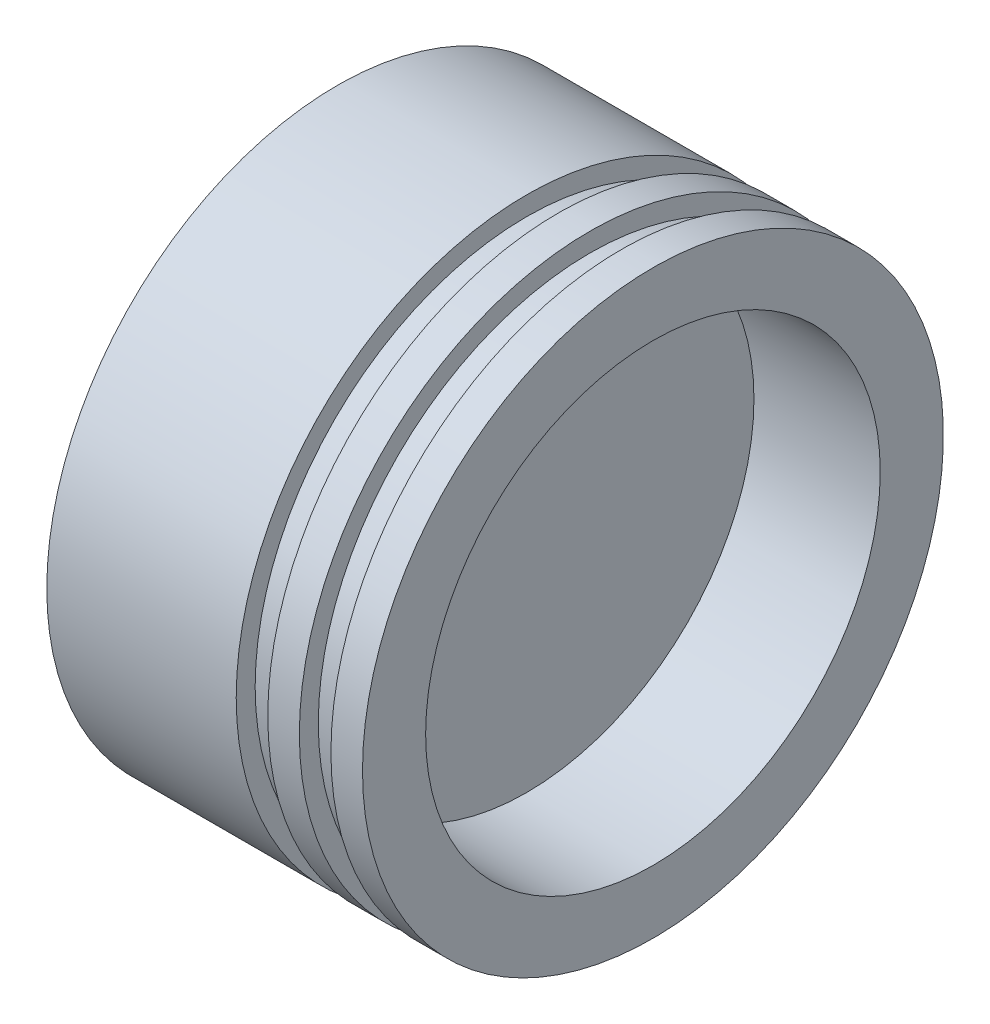
ISO-10303-21;
HEADER;
FILE_DESCRIPTION(('STEP AP214'),'2;1');
FILE_NAME('part.step','',(''),(''),'','','');
FILE_SCHEMA(('AUTOMOTIVE_DESIGN { 1 0 10303 214 1 1 1 1 }'));
ENDSEC;
DATA;
#1=APPLICATION_CONTEXT('core data for automotive mechanical design processes');
#2=APPLICATION_PROTOCOL_DEFINITION('international standard','automotive_design',2000,#1);
#3=PRODUCT_CONTEXT('',#1,'mechanical');
#4=PRODUCT('Part','Part','',(#3));
#5=PRODUCT_RELATED_PRODUCT_CATEGORY('part','',(#4));
#6=PRODUCT_DEFINITION_FORMATION('','',#4);
#7=PRODUCT_DEFINITION_CONTEXT('part definition',#1,'design');
#8=PRODUCT_DEFINITION('design','',#6,#7);
#9=PRODUCT_DEFINITION_SHAPE('','',#8);
#10=(LENGTH_UNIT() NAMED_UNIT(*) SI_UNIT(.MILLI.,.METRE.));
#11=(NAMED_UNIT(*) PLANE_ANGLE_UNIT() SI_UNIT($,.RADIAN.));
#12=(NAMED_UNIT(*) SI_UNIT($,.STERADIAN.) SOLID_ANGLE_UNIT());
#13=UNCERTAINTY_MEASURE_WITH_UNIT(LENGTH_MEASURE(1.E-05),#10,'distance_accuracy_value','');
#14=(GEOMETRIC_REPRESENTATION_CONTEXT(3) GLOBAL_UNCERTAINTY_ASSIGNED_CONTEXT((#13)) GLOBAL_UNIT_ASSIGNED_CONTEXT((#10,
#11,#12)) REPRESENTATION_CONTEXT('',''));
#15=CARTESIAN_POINT('',(0.,0.,0.));
#16=DIRECTION('',(0.,0.,1.));
#17=DIRECTION('',(1.,0.,0.));
#18=AXIS2_PLACEMENT_3D('',#15,#16,#17);
#19=CARTESIAN_POINT('',(0.,0.,0.));
#20=DIRECTION('',(1.,0.,0.));
#21=DIRECTION('',(0.,0.,-1.));
#22=AXIS2_PLACEMENT_3D('',#19,#20,#21);
#23=PLANE('',#22);
#24=CARTESIAN_POINT('',(0.,0.,0.));
#25=DIRECTION('',(-1.,0.,0.));
#26=DIRECTION('',(0.,0.,1.));
#27=AXIS2_PLACEMENT_3D('',#24,#25,#26);
#28=CIRCLE('',#27,46.);
#29=CARTESIAN_POINT('',(0.,0.,46.));
#30=VERTEX_POINT('',#29);
#31=EDGE_CURVE('E10',#30,#30,#28,.T.);
#32=ORIENTED_EDGE('',*,*,#31,.T.);
#33=EDGE_LOOP('',(#32));
#34=FACE_BOUND('',#33,.T.);
#35=ADVANCED_FACE('F35',(#34),#23,.F.);
#36=CARTESIAN_POINT('',(0.,0.,0.));
#37=DIRECTION('',(-1.,0.,0.));
#38=DIRECTION('',(0.,0.,1.));
#39=AXIS2_PLACEMENT_3D('',#36,#37,#38);
#40=CYLINDRICAL_SURFACE('',#39,46.);
#41=ORIENTED_EDGE('',*,*,#31,.F.);
#42=EDGE_LOOP('',(#41));
#43=FACE_BOUND('',#42,.T.);
#44=CARTESIAN_POINT('',(30.,0.,0.));
#45=DIRECTION('',(-1.,0.,0.));
#46=DIRECTION('',(0.,0.,1.));
#47=AXIS2_PLACEMENT_3D('',#44,#45,#46);
#48=CIRCLE('',#47,46.);
#49=CARTESIAN_POINT('',(30.,0.,46.));
#50=VERTEX_POINT('',#49);
#51=EDGE_CURVE('E41',#50,#50,#48,.T.);
#52=ORIENTED_EDGE('',*,*,#51,.T.);
#53=EDGE_LOOP('',(#52));
#54=FACE_BOUND('',#53,.T.);
#55=ADVANCED_FACE('F91',(#43,#54),#40,.T.);
#56=CARTESIAN_POINT('',(30.,46.,0.));
#57=DIRECTION('',(-1.,0.,0.));
#58=DIRECTION('',(0.,0.,1.));
#59=AXIS2_PLACEMENT_3D('',#56,#57,#58);
#60=PLANE('',#59);
#61=ORIENTED_EDGE('',*,*,#51,.F.);
#62=EDGE_LOOP('',(#61));
#63=FACE_BOUND('',#62,.T.);
#64=CARTESIAN_POINT('',(30.,0.,0.));
#65=DIRECTION('',(-1.,0.,0.));
#66=DIRECTION('',(0.,0.,1.));
#67=AXIS2_PLACEMENT_3D('',#64,#65,#66);
#68=CIRCLE('',#67,43.);
#69=CARTESIAN_POINT('',(30.,0.,43.));
#70=VERTEX_POINT('',#69);
#71=EDGE_CURVE('E45',#70,#70,#68,.T.);
#72=ORIENTED_EDGE('',*,*,#71,.T.);
#73=EDGE_LOOP('',(#72));
#74=FACE_BOUND('',#73,.T.);
#75=ADVANCED_FACE('F95',(#63,#74),#60,.F.);
#76=CARTESIAN_POINT('',(0.,0.,0.));
#77=DIRECTION('',(-1.,0.,0.));
#78=DIRECTION('',(0.,0.,1.));
#79=AXIS2_PLACEMENT_3D('',#76,#77,#78);
#80=CYLINDRICAL_SURFACE('',#79,43.);
#81=ORIENTED_EDGE('',*,*,#71,.F.);
#82=EDGE_LOOP('',(#81));
#83=FACE_BOUND('',#82,.T.);
#84=CARTESIAN_POINT('',(35.,0.,0.));
#85=DIRECTION('',(-1.,0.,0.));
#86=DIRECTION('',(0.,0.,1.));
#87=AXIS2_PLACEMENT_3D('',#84,#85,#86);
#88=CIRCLE('',#87,43.);
#89=CARTESIAN_POINT('',(35.,0.,43.));
#90=VERTEX_POINT('',#89);
#91=EDGE_CURVE('E49',#90,#90,#88,.T.);
#92=ORIENTED_EDGE('',*,*,#91,.T.);
#93=EDGE_LOOP('',(#92));
#94=FACE_BOUND('',#93,.T.);
#95=ADVANCED_FACE('F100',(#83,#94),#80,.T.);
#96=CARTESIAN_POINT('',(35.,43.,0.));
#97=DIRECTION('',(1.,0.,0.));
#98=DIRECTION('',(0.,0.,-1.));
#99=AXIS2_PLACEMENT_3D('',#96,#97,#98);
#100=PLANE('',#99);
#101=ORIENTED_EDGE('',*,*,#91,.F.);
#102=EDGE_LOOP('',(#101));
#103=FACE_BOUND('',#102,.T.);
#104=CARTESIAN_POINT('',(35.,0.,0.));
#105=DIRECTION('',(-1.,0.,0.));
#106=DIRECTION('',(0.,0.,1.));
#107=AXIS2_PLACEMENT_3D('',#104,#105,#106);
#108=CIRCLE('',#107,46.);
#109=CARTESIAN_POINT('',(35.,0.,46.));
#110=VERTEX_POINT('',#109);
#111=EDGE_CURVE('E54',#110,#110,#108,.T.);
#112=ORIENTED_EDGE('',*,*,#111,.T.);
#113=EDGE_LOOP('',(#112));
#114=FACE_BOUND('',#113,.T.);
#115=ADVANCED_FACE('F106',(#103,#114),#100,.F.);
#116=CARTESIAN_POINT('',(0.,0.,0.));
#117=DIRECTION('',(-1.,0.,0.));
#118=DIRECTION('',(0.,0.,1.));
#119=AXIS2_PLACEMENT_3D('',#116,#117,#118);
#120=CYLINDRICAL_SURFACE('',#119,46.);
#121=ORIENTED_EDGE('',*,*,#111,.F.);
#122=EDGE_LOOP('',(#121));
#123=FACE_BOUND('',#122,.T.);
#124=CARTESIAN_POINT('',(40.,0.,0.));
#125=DIRECTION('',(-1.,0.,0.));
#126=DIRECTION('',(0.,0.,1.));
#127=AXIS2_PLACEMENT_3D('',#124,#125,#126);
#128=CIRCLE('',#127,46.);
#129=CARTESIAN_POINT('',(40.,0.,46.));
#130=VERTEX_POINT('',#129);
#131=EDGE_CURVE('E57',#130,#130,#128,.T.);
#132=ORIENTED_EDGE('',*,*,#131,.T.);
#133=EDGE_LOOP('',(#132));
#134=FACE_BOUND('',#133,.T.);
#135=ADVANCED_FACE('F110',(#123,#134),#120,.T.);
#136=CARTESIAN_POINT('',(40.,46.,0.));
#137=DIRECTION('',(-1.,0.,0.));
#138=DIRECTION('',(0.,0.,1.));
#139=AXIS2_PLACEMENT_3D('',#136,#137,#138);
#140=PLANE('',#139);
#141=ORIENTED_EDGE('',*,*,#131,.F.);
#142=EDGE_LOOP('',(#141));
#143=FACE_BOUND('',#142,.T.);
#144=CARTESIAN_POINT('',(40.,0.,0.));
#145=DIRECTION('',(-1.,0.,0.));
#146=DIRECTION('',(0.,0.,1.));
#147=AXIS2_PLACEMENT_3D('',#144,#145,#146);
#148=CIRCLE('',#147,43.);
#149=CARTESIAN_POINT('',(40.,0.,43.));
#150=VERTEX_POINT('',#149);
#151=EDGE_CURVE('E60',#150,#150,#148,.T.);
#152=ORIENTED_EDGE('',*,*,#151,.T.);
#153=EDGE_LOOP('',(#152));
#154=FACE_BOUND('',#153,.T.);
#155=ADVANCED_FACE('F114',(#143,#154),#140,.F.);
#156=CARTESIAN_POINT('',(0.,0.,0.));
#157=DIRECTION('',(-1.,0.,0.));
#158=DIRECTION('',(0.,0.,1.));
#159=AXIS2_PLACEMENT_3D('',#156,#157,#158);
#160=CYLINDRICAL_SURFACE('',#159,43.);
#161=ORIENTED_EDGE('',*,*,#151,.F.);
#162=EDGE_LOOP('',(#161));
#163=FACE_BOUND('',#162,.T.);
#164=CARTESIAN_POINT('',(45.,0.,0.));
#165=DIRECTION('',(-1.,0.,0.));
#166=DIRECTION('',(0.,0.,1.));
#167=AXIS2_PLACEMENT_3D('',#164,#165,#166);
#168=CIRCLE('',#167,43.);
#169=CARTESIAN_POINT('',(45.,0.,43.));
#170=VERTEX_POINT('',#169);
#171=EDGE_CURVE('E63',#170,#170,#168,.T.);
#172=ORIENTED_EDGE('',*,*,#171,.T.);
#173=EDGE_LOOP('',(#172));
#174=FACE_BOUND('',#173,.T.);
#175=ADVANCED_FACE('F118',(#163,#174),#160,.T.);
#176=CARTESIAN_POINT('',(45.,43.,0.));
#177=DIRECTION('',(1.,0.,0.));
#178=DIRECTION('',(0.,0.,-1.));
#179=AXIS2_PLACEMENT_3D('',#176,#177,#178);
#180=PLANE('',#179);
#181=ORIENTED_EDGE('',*,*,#171,.F.);
#182=EDGE_LOOP('',(#181));
#183=FACE_BOUND('',#182,.T.);
#184=CARTESIAN_POINT('',(45.,0.,0.));
#185=DIRECTION('',(-1.,0.,0.));
#186=DIRECTION('',(0.,0.,1.));
#187=AXIS2_PLACEMENT_3D('',#184,#185,#186);
#188=CIRCLE('',#187,46.);
#189=CARTESIAN_POINT('',(45.,0.,46.));
#190=VERTEX_POINT('',#189);
#191=EDGE_CURVE('E66',#190,#190,#188,.T.);
#192=ORIENTED_EDGE('',*,*,#191,.T.);
#193=EDGE_LOOP('',(#192));
#194=FACE_BOUND('',#193,.T.);
#195=ADVANCED_FACE('F122',(#183,#194),#180,.F.);
#196=CARTESIAN_POINT('',(0.,0.,0.));
#197=DIRECTION('',(-1.,0.,0.));
#198=DIRECTION('',(0.,0.,1.));
#199=AXIS2_PLACEMENT_3D('',#196,#197,#198);
#200=CYLINDRICAL_SURFACE('',#199,46.);
#201=ORIENTED_EDGE('',*,*,#191,.F.);
#202=EDGE_LOOP('',(#201));
#203=FACE_BOUND('',#202,.T.);
#204=CARTESIAN_POINT('',(50.,0.,0.));
#205=DIRECTION('',(-1.,0.,0.));
#206=DIRECTION('',(0.,0.,1.));
#207=AXIS2_PLACEMENT_3D('',#204,#205,#206);
#208=CIRCLE('',#207,46.);
#209=CARTESIAN_POINT('',(50.,0.,46.));
#210=VERTEX_POINT('',#209);
#211=EDGE_CURVE('E69',#210,#210,#208,.T.);
#212=ORIENTED_EDGE('',*,*,#211,.T.);
#213=EDGE_LOOP('',(#212));
#214=FACE_BOUND('',#213,.T.);
#215=ADVANCED_FACE('F126',(#203,#214),#200,.T.);
#216=CARTESIAN_POINT('',(50.,46.,0.));
#217=DIRECTION('',(-1.,0.,0.));
#218=DIRECTION('',(0.,0.,1.));
#219=AXIS2_PLACEMENT_3D('',#216,#217,#218);
#220=PLANE('',#219);
#221=ORIENTED_EDGE('',*,*,#211,.F.);
#222=EDGE_LOOP('',(#221));
#223=FACE_BOUND('',#222,.T.);
#224=CARTESIAN_POINT('',(50.,0.,0.));
#225=DIRECTION('',(-1.,0.,0.));
#226=DIRECTION('',(0.,0.,1.));
#227=AXIS2_PLACEMENT_3D('',#224,#225,#226);
#228=CIRCLE('',#227,36.);
#229=CARTESIAN_POINT('',(50.,0.,36.));
#230=VERTEX_POINT('',#229);
#231=EDGE_CURVE('E72',#230,#230,#228,.T.);
#232=ORIENTED_EDGE('',*,*,#231,.T.);
#233=EDGE_LOOP('',(#232));
#234=FACE_BOUND('',#233,.T.);
#235=ADVANCED_FACE('F87',(#223,#234),#220,.F.);
#236=CARTESIAN_POINT('',(0.,0.,0.));
#237=DIRECTION('',(-1.,0.,0.));
#238=DIRECTION('',(0.,0.,1.));
#239=AXIS2_PLACEMENT_3D('',#236,#237,#238);
#240=CYLINDRICAL_SURFACE('',#239,36.);
#241=ORIENTED_EDGE('',*,*,#231,.F.);
#242=EDGE_LOOP('',(#241));
#243=FACE_BOUND('',#242,.T.);
#244=CARTESIAN_POINT('',(30.,0.,0.));
#245=DIRECTION('',(-1.,0.,0.));
#246=DIRECTION('',(0.,0.,1.));
#247=AXIS2_PLACEMENT_3D('',#244,#245,#246);
#248=CIRCLE('',#247,36.);
#249=CARTESIAN_POINT('',(30.,0.,36.));
#250=VERTEX_POINT('',#249);
#251=EDGE_CURVE('E75',#250,#250,#248,.T.);
#252=ORIENTED_EDGE('',*,*,#251,.T.);
#253=EDGE_LOOP('',(#252));
#254=FACE_BOUND('',#253,.T.);
#255=ADVANCED_FACE('F79',(#243,#254),#240,.F.);
#256=CARTESIAN_POINT('',(30.,36.,0.));
#257=DIRECTION('',(-1.,0.,0.));
#258=DIRECTION('',(0.,0.,1.));
#259=AXIS2_PLACEMENT_3D('',#256,#257,#258);
#260=PLANE('',#259);
#261=ORIENTED_EDGE('',*,*,#251,.F.);
#262=EDGE_LOOP('',(#261));
#263=FACE_BOUND('',#262,.T.);
#264=ADVANCED_FACE('F81',(#263),#260,.F.);
#265=CLOSED_SHELL('',(#35,#55,#75,#95,#115,#135,#155,#175,#195,#215,#235,#255,#264));
#266=MANIFOLD_SOLID_BREP('B2',#265);
#267=ADVANCED_BREP_SHAPE_REPRESENTATION('',(#18,#266),#14);
#268=SHAPE_DEFINITION_REPRESENTATION(#9,#267);
ENDSEC;
END-ISO-10303-21;
